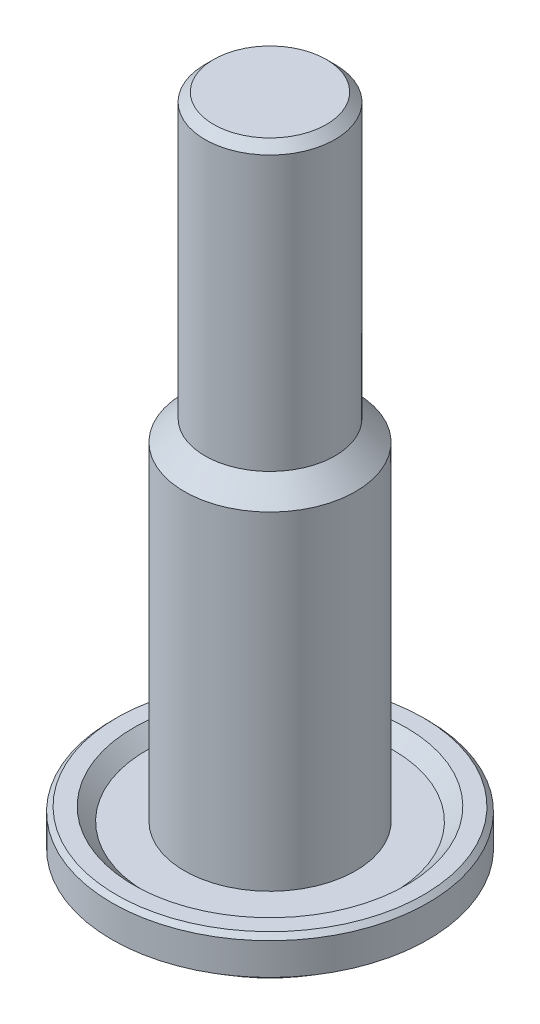
ISO-10303-21;
HEADER;
FILE_DESCRIPTION(('STEP AP214'),'2;1');
FILE_NAME('part.step','',(''),(''),'','','');
FILE_SCHEMA(('AUTOMOTIVE_DESIGN { 1 0 10303 214 1 1 1 1 }'));
ENDSEC;
DATA;
#1=APPLICATION_CONTEXT('core data for automotive mechanical design processes');
#2=APPLICATION_PROTOCOL_DEFINITION('international standard','automotive_design',2000,#1);
#3=PRODUCT_CONTEXT('',#1,'mechanical');
#4=PRODUCT('Part','Part','',(#3));
#5=PRODUCT_RELATED_PRODUCT_CATEGORY('part','',(#4));
#6=PRODUCT_DEFINITION_FORMATION('','',#4);
#7=PRODUCT_DEFINITION_CONTEXT('part definition',#1,'design');
#8=PRODUCT_DEFINITION('design','',#6,#7);
#9=PRODUCT_DEFINITION_SHAPE('','',#8);
#10=(LENGTH_UNIT() NAMED_UNIT(*) SI_UNIT(.MILLI.,.METRE.));
#11=(NAMED_UNIT(*) PLANE_ANGLE_UNIT() SI_UNIT($,.RADIAN.));
#12=(NAMED_UNIT(*) SI_UNIT($,.STERADIAN.) SOLID_ANGLE_UNIT());
#13=UNCERTAINTY_MEASURE_WITH_UNIT(LENGTH_MEASURE(1.E-05),#10,'distance_accuracy_value','');
#14=(GEOMETRIC_REPRESENTATION_CONTEXT(3) GLOBAL_UNCERTAINTY_ASSIGNED_CONTEXT((#13)) GLOBAL_UNIT_ASSIGNED_CONTEXT((#10,
#11,#12)) REPRESENTATION_CONTEXT('',''));
#15=CARTESIAN_POINT('',(0.,0.,0.));
#16=DIRECTION('',(0.,0.,1.));
#17=DIRECTION('',(1.,0.,0.));
#18=AXIS2_PLACEMENT_3D('',#15,#16,#17);
#19=CARTESIAN_POINT('',(0.,40.0558,0.));
#20=DIRECTION('',(0.,-1.,0.));
#21=DIRECTION('',(0.,0.,-1.));
#22=AXIS2_PLACEMENT_3D('',#19,#20,#21);
#23=PLANE('',#22);
#24=CARTESIAN_POINT('',(0.,40.0558,0.));
#25=DIRECTION('',(0.,-1.,0.));
#26=DIRECTION('',(0.,0.,-1.));
#27=AXIS2_PLACEMENT_3D('',#24,#25,#26);
#28=CIRCLE('',#27,3.302);
#29=CARTESIAN_POINT('',(0.,40.0558,-3.302));
#30=VERTEX_POINT('',#29);
#31=EDGE_CURVE('E10',#30,#30,#28,.T.);
#32=ORIENTED_EDGE('',*,*,#31,.F.);
#33=EDGE_LOOP('',(#32));
#34=FACE_BOUND('',#33,.T.);
#35=ADVANCED_FACE('F31',(#34),#23,.F.);
#36=CARTESIAN_POINT('',(0.,40.0558,0.));
#37=DIRECTION('',(0.,-1.,0.));
#38=DIRECTION('',(0.,0.,-1.));
#39=AXIS2_PLACEMENT_3D('',#36,#37,#38);
#40=CONICAL_SURFACE('',#39,3.302,0.785398163397447);
#41=CARTESIAN_POINT('',(0.,39.5478,0.));
#42=DIRECTION('',(0.,-1.,0.));
#43=DIRECTION('',(0.,0.,-1.));
#44=AXIS2_PLACEMENT_3D('',#41,#42,#43);
#45=CIRCLE('',#44,3.81);
#46=CARTESIAN_POINT('',(0.,39.5478,-3.81));
#47=VERTEX_POINT('',#46);
#48=EDGE_CURVE('E37',#47,#47,#45,.T.);
#49=ORIENTED_EDGE('',*,*,#48,.F.);
#50=EDGE_LOOP('',(#49));
#51=FACE_BOUND('',#50,.T.);
#52=ORIENTED_EDGE('',*,*,#31,.T.);
#53=EDGE_LOOP('',(#52));
#54=FACE_BOUND('',#53,.T.);
#55=ADVANCED_FACE('F142',(#51,#54),#40,.T.);
#56=CARTESIAN_POINT('',(0.,20.955,0.));
#57=DIRECTION('',(0.,-1.,0.));
#58=DIRECTION('',(0.,0.,-1.));
#59=AXIS2_PLACEMENT_3D('',#56,#57,#58);
#60=CYLINDRICAL_SURFACE('',#59,3.81);
#61=CARTESIAN_POINT('',(0.,23.495,0.));
#62=DIRECTION('',(0.,-1.,0.));
#63=DIRECTION('',(0.,0.,-1.));
#64=AXIS2_PLACEMENT_3D('',#61,#62,#63);
#65=CIRCLE('',#64,3.81);
#66=CARTESIAN_POINT('',(0.,23.495,-3.81));
#67=VERTEX_POINT('',#66);
#68=EDGE_CURVE('E41',#67,#67,#65,.T.);
#69=ORIENTED_EDGE('',*,*,#68,.F.);
#70=EDGE_LOOP('',(#69));
#71=FACE_BOUND('',#70,.T.);
#72=ORIENTED_EDGE('',*,*,#48,.T.);
#73=EDGE_LOOP('',(#72));
#74=FACE_BOUND('',#73,.T.);
#75=ADVANCED_FACE('F137',(#71,#74),#60,.T.);
#76=CARTESIAN_POINT('',(0.,23.495,0.));
#77=DIRECTION('',(0.,-1.,0.));
#78=DIRECTION('',(0.,0.,-1.));
#79=AXIS2_PLACEMENT_3D('',#76,#77,#78);
#80=CONICAL_SURFACE('',#79,3.81,0.785398163397449);
#81=CARTESIAN_POINT('',(0.,22.2885,0.));
#82=DIRECTION('',(0.,-1.,0.));
#83=DIRECTION('',(0.,0.,-1.));
#84=AXIS2_PLACEMENT_3D('',#81,#82,#83);
#85=CIRCLE('',#84,5.0165);
#86=CARTESIAN_POINT('',(0.,22.2885,-5.0165));
#87=VERTEX_POINT('',#86);
#88=EDGE_CURVE('E45',#87,#87,#85,.T.);
#89=ORIENTED_EDGE('',*,*,#88,.F.);
#90=EDGE_LOOP('',(#89));
#91=FACE_BOUND('',#90,.T.);
#92=ORIENTED_EDGE('',*,*,#68,.T.);
#93=EDGE_LOOP('',(#92));
#94=FACE_BOUND('',#93,.T.);
#95=ADVANCED_FACE('F131',(#91,#94),#80,.T.);
#96=CARTESIAN_POINT('',(0.,20.955,0.));
#97=DIRECTION('',(0.,-1.,0.));
#98=DIRECTION('',(0.,0.,-1.));
#99=AXIS2_PLACEMENT_3D('',#96,#97,#98);
#100=CYLINDRICAL_SURFACE('',#99,5.0165);
#101=CARTESIAN_POINT('',(0.,3.048,0.));
#102=DIRECTION('',(0.,-1.,0.));
#103=DIRECTION('',(0.,0.,-1.));
#104=AXIS2_PLACEMENT_3D('',#101,#102,#103);
#105=CIRCLE('',#104,5.0165);
#106=CARTESIAN_POINT('',(0.,3.048,-5.0165));
#107=VERTEX_POINT('',#106);
#108=EDGE_CURVE('E50',#107,#107,#105,.T.);
#109=ORIENTED_EDGE('',*,*,#108,.F.);
#110=EDGE_LOOP('',(#109));
#111=FACE_BOUND('',#110,.T.);
#112=ORIENTED_EDGE('',*,*,#88,.T.);
#113=EDGE_LOOP('',(#112));
#114=FACE_BOUND('',#113,.T.);
#115=ADVANCED_FACE('F125',(#111,#114),#100,.T.);
#116=CARTESIAN_POINT('',(0.,3.04799999999999,5.0165));
#117=DIRECTION('',(0.,-1.,0.));
#118=DIRECTION('',(0.,0.,-1.));
#119=AXIS2_PLACEMENT_3D('',#116,#117,#118);
#120=PLANE('',#119);
#121=CARTESIAN_POINT('',(0.,3.048,0.));
#122=DIRECTION('',(0.,-1.,0.));
#123=DIRECTION('',(0.,0.,-1.));
#124=AXIS2_PLACEMENT_3D('',#121,#122,#123);
#125=CIRCLE('',#124,7.2263);
#126=CARTESIAN_POINT('',(0.,3.048,-7.2263));
#127=VERTEX_POINT('',#126);
#128=EDGE_CURVE('E53',#127,#127,#125,.T.);
#129=ORIENTED_EDGE('',*,*,#128,.F.);
#130=EDGE_LOOP('',(#129));
#131=FACE_BOUND('',#130,.T.);
#132=ORIENTED_EDGE('',*,*,#108,.T.);
#133=EDGE_LOOP('',(#132));
#134=FACE_BOUND('',#133,.T.);
#135=ADVANCED_FACE('F119',(#131,#134),#120,.F.);
#136=CARTESIAN_POINT('',(0.,3.048,0.));
#137=DIRECTION('',(0.,1.,0.));
#138=DIRECTION('',(0.,0.,1.));
#139=AXIS2_PLACEMENT_3D('',#136,#137,#138);
#140=CONICAL_SURFACE('',#139,7.2263,0.785398163397448);
#141=CARTESIAN_POINT('',(0.,3.81,0.));
#142=DIRECTION('',(0.,-1.,0.));
#143=DIRECTION('',(0.,0.,-1.));
#144=AXIS2_PLACEMENT_3D('',#141,#142,#143);
#145=CIRCLE('',#144,7.9883);
#146=CARTESIAN_POINT('',(0.,3.81,-7.9883));
#147=VERTEX_POINT('',#146);
#148=EDGE_CURVE('E56',#147,#147,#145,.T.);
#149=ORIENTED_EDGE('',*,*,#148,.F.);
#150=EDGE_LOOP('',(#149));
#151=FACE_BOUND('',#150,.T.);
#152=ORIENTED_EDGE('',*,*,#128,.T.);
#153=EDGE_LOOP('',(#152));
#154=FACE_BOUND('',#153,.T.);
#155=ADVANCED_FACE('F113',(#151,#154),#140,.F.);
#156=CARTESIAN_POINT('',(0.,3.81,7.9883));
#157=DIRECTION('',(0.,-1.,0.));
#158=DIRECTION('',(0.,0.,-1.));
#159=AXIS2_PLACEMENT_3D('',#156,#157,#158);
#160=PLANE('',#159);
#161=CARTESIAN_POINT('',(0.,3.81,0.));
#162=DIRECTION('',(0.,-1.,0.));
#163=DIRECTION('',(0.,0.,-1.));
#164=AXIS2_PLACEMENT_3D('',#161,#162,#163);
#165=CIRCLE('',#164,8.98889231636793);
#166=CARTESIAN_POINT('',(0.,3.81,-8.98889231636793));
#167=VERTEX_POINT('',#166);
#168=EDGE_CURVE('E59',#167,#167,#165,.T.);
#169=ORIENTED_EDGE('',*,*,#168,.F.);
#170=EDGE_LOOP('',(#169));
#171=FACE_BOUND('',#170,.T.);
#172=ORIENTED_EDGE('',*,*,#148,.T.);
#173=EDGE_LOOP('',(#172));
#174=FACE_BOUND('',#173,.T.);
#175=ADVANCED_FACE('F107',(#171,#174),#160,.F.);
#176=CARTESIAN_POINT('',(0.,3.81,0.));
#177=DIRECTION('',(0.,-1.,0.));
#178=DIRECTION('',(0.,0.,-1.));
#179=AXIS2_PLACEMENT_3D('',#176,#177,#178);
#180=CONICAL_SURFACE('',#179,8.98889231636793,0.785398163397439);
#181=CARTESIAN_POINT('',(0.,3.54059231636792,0.));
#182=DIRECTION('',(0.,-1.,0.));
#183=DIRECTION('',(0.,0.,-1.));
#184=AXIS2_PLACEMENT_3D('',#181,#182,#183);
#185=CIRCLE('',#184,9.2583);
#186=CARTESIAN_POINT('',(0.,3.54059231636792,-9.2583));
#187=VERTEX_POINT('',#186);
#188=EDGE_CURVE('E62',#187,#187,#185,.T.);
#189=ORIENTED_EDGE('',*,*,#188,.F.);
#190=EDGE_LOOP('',(#189));
#191=FACE_BOUND('',#190,.T.);
#192=ORIENTED_EDGE('',*,*,#168,.T.);
#193=EDGE_LOOP('',(#192));
#194=FACE_BOUND('',#193,.T.);
#195=ADVANCED_FACE('F101',(#191,#194),#180,.T.);
#196=CARTESIAN_POINT('',(0.,20.955,0.));
#197=DIRECTION('',(0.,-1.,0.));
#198=DIRECTION('',(0.,0.,-1.));
#199=AXIS2_PLACEMENT_3D('',#196,#197,#198);
#200=CYLINDRICAL_SURFACE('',#199,9.2583);
#201=CARTESIAN_POINT('',(0.,1.6764,0.));
#202=DIRECTION('',(0.,-1.,0.));
#203=DIRECTION('',(0.,0.,-1.));
#204=AXIS2_PLACEMENT_3D('',#201,#202,#203);
#205=CIRCLE('',#204,9.2583);
#206=CARTESIAN_POINT('',(0.,1.6764,-9.2583));
#207=VERTEX_POINT('',#206);
#208=EDGE_CURVE('E65',#207,#207,#205,.T.);
#209=ORIENTED_EDGE('',*,*,#208,.F.);
#210=EDGE_LOOP('',(#209));
#211=FACE_BOUND('',#210,.T.);
#212=ORIENTED_EDGE('',*,*,#188,.T.);
#213=EDGE_LOOP('',(#212));
#214=FACE_BOUND('',#213,.T.);
#215=ADVANCED_FACE('F95',(#211,#214),#200,.T.);
#216=CARTESIAN_POINT('',(0.,1.6764,0.));
#217=DIRECTION('',(0.,1.,0.));
#218=DIRECTION('',(0.,0.,1.));
#219=AXIS2_PLACEMENT_3D('',#216,#217,#218);
#220=CONICAL_SURFACE('',#219,9.2583,0.945910088879307);
#221=CARTESIAN_POINT('',(0.,0.,0.));
#222=DIRECTION('',(0.,-1.,0.));
#223=DIRECTION('',(0.,0.,-1.));
#224=AXIS2_PLACEMENT_3D('',#221,#222,#223);
#225=CIRCLE('',#224,6.9342);
#226=CARTESIAN_POINT('',(0.,0.,-6.9342));
#227=VERTEX_POINT('',#226);
#228=EDGE_CURVE('E68',#227,#227,#225,.T.);
#229=ORIENTED_EDGE('',*,*,#228,.F.);
#230=EDGE_LOOP('',(#229));
#231=FACE_BOUND('',#230,.T.);
#232=ORIENTED_EDGE('',*,*,#208,.T.);
#233=EDGE_LOOP('',(#232));
#234=FACE_BOUND('',#233,.T.);
#235=ADVANCED_FACE('F89',(#231,#234),#220,.T.);
#236=CARTESIAN_POINT('',(0.,0.,6.9342));
#237=DIRECTION('',(0.,1.,0.));
#238=DIRECTION('',(0.,0.,1.));
#239=AXIS2_PLACEMENT_3D('',#236,#237,#238);
#240=PLANE('',#239);
#241=CARTESIAN_POINT('',(0.,0.,0.));
#242=DIRECTION('',(0.,-1.,0.));
#243=DIRECTION('',(0.,0.,-1.));
#244=AXIS2_PLACEMENT_3D('',#241,#242,#243);
#245=CIRCLE('',#244,2.54);
#246=CARTESIAN_POINT('',(0.,0.,-2.54));
#247=VERTEX_POINT('',#246);
#248=EDGE_CURVE('E71',#247,#247,#245,.T.);
#249=ORIENTED_EDGE('',*,*,#248,.F.);
#250=EDGE_LOOP('',(#249));
#251=FACE_BOUND('',#250,.T.);
#252=ORIENTED_EDGE('',*,*,#228,.T.);
#253=EDGE_LOOP('',(#252));
#254=FACE_BOUND('',#253,.T.);
#255=ADVANCED_FACE('F83',(#251,#254),#240,.F.);
#256=CARTESIAN_POINT('',(0.,20.955,0.));
#257=DIRECTION('',(0.,-1.,0.));
#258=DIRECTION('',(0.,0.,-1.));
#259=AXIS2_PLACEMENT_3D('',#256,#257,#258);
#260=CYLINDRICAL_SURFACE('',#259,2.54);
#261=CARTESIAN_POINT('',(0.,20.955,0.));
#262=DIRECTION('',(0.,-1.,0.));
#263=DIRECTION('',(0.,0.,-1.));
#264=AXIS2_PLACEMENT_3D('',#261,#262,#263);
#265=CIRCLE('',#264,2.54);
#266=CARTESIAN_POINT('',(0.,20.955,-2.54));
#267=VERTEX_POINT('',#266);
#268=EDGE_CURVE('E74',#267,#267,#265,.T.);
#269=ORIENTED_EDGE('',*,*,#268,.F.);
#270=EDGE_LOOP('',(#269));
#271=FACE_BOUND('',#270,.T.);
#272=ORIENTED_EDGE('',*,*,#248,.T.);
#273=EDGE_LOOP('',(#272));
#274=FACE_BOUND('',#273,.T.);
#275=ADVANCED_FACE('F80',(#271,#274),#260,.F.);
#276=CARTESIAN_POINT('',(0.,20.955,2.54));
#277=DIRECTION('',(0.,1.,0.));
#278=DIRECTION('',(0.,0.,1.));
#279=AXIS2_PLACEMENT_3D('',#276,#277,#278);
#280=PLANE('',#279);
#281=ORIENTED_EDGE('',*,*,#268,.T.);
#282=EDGE_LOOP('',(#281));
#283=FACE_BOUND('',#282,.T.);
#284=ADVANCED_FACE('F78',(#283),#280,.F.);
#285=CLOSED_SHELL('',(#35,#55,#75,#95,#115,#135,#155,#175,#195,#215,#235,#255,#275,#284));
#286=MANIFOLD_SOLID_BREP('B2',#285);
#287=ADVANCED_BREP_SHAPE_REPRESENTATION('',(#18,#286),#14);
#288=SHAPE_DEFINITION_REPRESENTATION(#9,#287);
ENDSEC;
END-ISO-10303-21;
